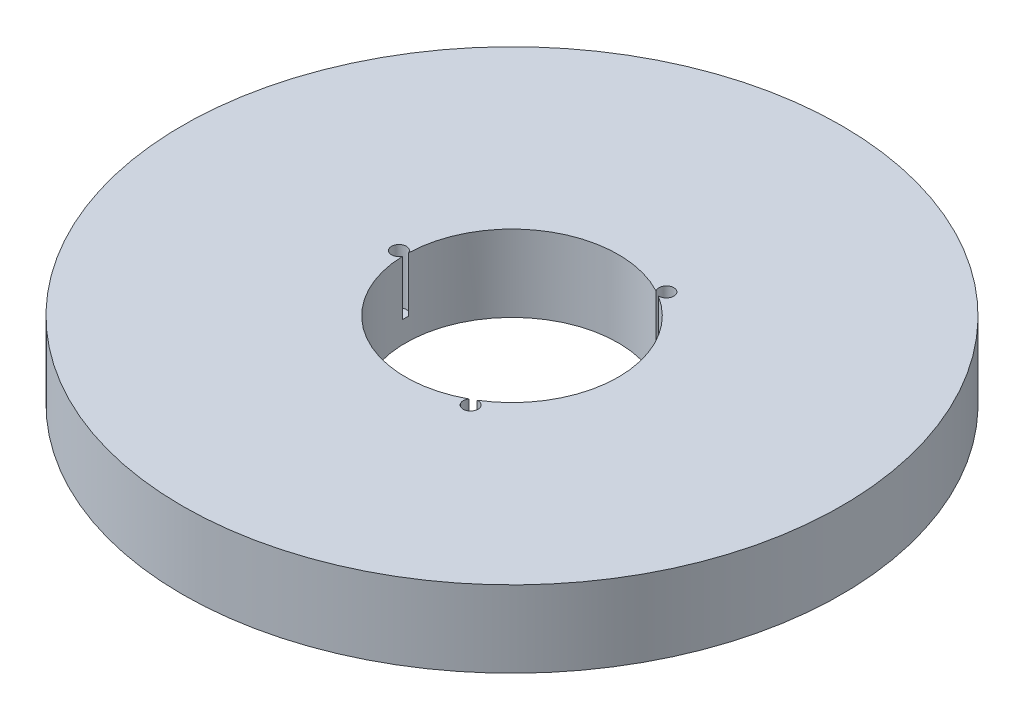
ISO-10303-21;
HEADER;
FILE_DESCRIPTION(('STEP AP214'),'2;1');
FILE_NAME('part.step','',(''),(''),'','','');
FILE_SCHEMA(('AUTOMOTIVE_DESIGN { 1 0 10303 214 1 1 1 1 }'));
ENDSEC;
DATA;
#1=APPLICATION_CONTEXT('core data for automotive mechanical design processes');
#2=APPLICATION_PROTOCOL_DEFINITION('international standard','automotive_design',2000,#1);
#3=PRODUCT_CONTEXT('',#1,'mechanical');
#4=PRODUCT('Part','Part','',(#3));
#5=PRODUCT_RELATED_PRODUCT_CATEGORY('part','',(#4));
#6=PRODUCT_DEFINITION_FORMATION('','',#4);
#7=PRODUCT_DEFINITION_CONTEXT('part definition',#1,'design');
#8=PRODUCT_DEFINITION('design','',#6,#7);
#9=PRODUCT_DEFINITION_SHAPE('','',#8);
#10=(LENGTH_UNIT() NAMED_UNIT(*) SI_UNIT(.MILLI.,.METRE.));
#11=(NAMED_UNIT(*) PLANE_ANGLE_UNIT() SI_UNIT($,.RADIAN.));
#12=(NAMED_UNIT(*) SI_UNIT($,.STERADIAN.) SOLID_ANGLE_UNIT());
#13=UNCERTAINTY_MEASURE_WITH_UNIT(LENGTH_MEASURE(1.E-05),#10,'distance_accuracy_value','');
#14=(GEOMETRIC_REPRESENTATION_CONTEXT(3) GLOBAL_UNCERTAINTY_ASSIGNED_CONTEXT((#13)) GLOBAL_UNIT_ASSIGNED_CONTEXT((#10,
#11,#12)) REPRESENTATION_CONTEXT('',''));
#15=CARTESIAN_POINT('',(0.,0.,0.));
#16=DIRECTION('',(0.,0.,1.));
#17=DIRECTION('',(1.,0.,0.));
#18=AXIS2_PLACEMENT_3D('',#15,#16,#17);
#19=CARTESIAN_POINT('',(0.,18.,0.));
#20=DIRECTION('',(0.,-1.,0.));
#21=DIRECTION('',(0.,0.,-1.));
#22=AXIS2_PLACEMENT_3D('',#19,#20,#21);
#23=CYLINDRICAL_SURFACE('',#22,77.5);
#24=CARTESIAN_POINT('',(0.,18.,0.));
#25=DIRECTION('',(0.,1.,0.));
#26=DIRECTION('',(0.,0.,1.));
#27=AXIS2_PLACEMENT_3D('',#24,#25,#26);
#28=CIRCLE('',#27,77.5);
#29=CARTESIAN_POINT('',(0.,18.,77.5));
#30=VERTEX_POINT('',#29);
#31=EDGE_CURVE('E126',#30,#30,#28,.T.);
#32=ORIENTED_EDGE('',*,*,#31,.F.);
#33=EDGE_LOOP('',(#32));
#34=FACE_BOUND('',#33,.T.);
#35=CARTESIAN_POINT('',(0.,0.,0.));
#36=DIRECTION('',(0.,1.,0.));
#37=DIRECTION('',(0.,0.,1.));
#38=AXIS2_PLACEMENT_3D('',#35,#36,#37);
#39=CIRCLE('',#38,77.5);
#40=CARTESIAN_POINT('',(0.,0.,77.5));
#41=VERTEX_POINT('',#40);
#42=EDGE_CURVE('E124',#41,#41,#39,.T.);
#43=ORIENTED_EDGE('',*,*,#42,.T.);
#44=EDGE_LOOP('',(#43));
#45=FACE_BOUND('',#44,.T.);
#46=ADVANCED_FACE('F39',(#34,#45),#23,.T.);
#47=CARTESIAN_POINT('',(0.,18.,0.));
#48=DIRECTION('',(0.,1.,0.));
#49=DIRECTION('',(0.,0.,1.));
#50=AXIS2_PLACEMENT_3D('',#47,#48,#49);
#51=PLANE('',#50);
#52=CARTESIAN_POINT('',(13.2918245483509,18.,23.0221154430348));
#53=DIRECTION('',(0.,1.,0.));
#54=DIRECTION('',(0.866025403784436,0.,-0.500000000000004));
#55=AXIS2_PLACEMENT_3D('',#52,#53,#54);
#56=CIRCLE('',#55,1.74348970429529);
#57=CARTESIAN_POINT('',(11.8826075329255,18.,21.9955367795028));
#58=VERTEX_POINT('',#57);
#59=CARTESIAN_POINT('',(13.1073898544619,18.,21.2884083764651));
#60=VERTEX_POINT('',#59);
#61=EDGE_CURVE('E147',#58,#60,#56,.T.);
#62=ORIENTED_EDGE('',*,*,#61,.F.);
#63=CARTESIAN_POINT('',(0.,18.,0.));
#64=DIRECTION('',(0.,1.,0.));
#65=DIRECTION('',(0.,0.,1.));
#66=AXIS2_PLACEMENT_3D('',#63,#64,#65);
#67=CIRCLE('',#66,25.);
#68=CARTESIAN_POINT('',(-24.9899973873872,18.,0.707128403037722));
#69=VERTEX_POINT('',#68);
#70=EDGE_CURVE('E118',#69,#58,#67,.T.);
#71=ORIENTED_EDGE('',*,*,#70,.F.);
#72=CARTESIAN_POINT('',(-26.5836490967017,18.,0.));
#73=DIRECTION('',(0.,1.,0.));
#74=DIRECTION('',(0.,0.,1.));
#75=AXIS2_PLACEMENT_3D('',#72,#73,#74);
#76=CIRCLE('',#75,1.74348970429529);
#77=CARTESIAN_POINT('',(-24.9899973873872,18.,-0.707128403037722));
#78=VERTEX_POINT('',#77);
#79=EDGE_CURVE('E113',#78,#69,#76,.T.);
#80=ORIENTED_EDGE('',*,*,#79,.F.);
#81=CARTESIAN_POINT('',(11.8826075329252,18.,-21.995536779503));
#82=VERTEX_POINT('',#81);
#83=EDGE_CURVE('E106',#82,#78,#67,.T.);
#84=ORIENTED_EDGE('',*,*,#83,.F.);
#85=CARTESIAN_POINT('',(13.2918245483506,18.,-23.022115443035));
#86=DIRECTION('',(0.,1.,0.));
#87=DIRECTION('',(-0.866025403784443,0.,-0.499999999999992));
#88=AXIS2_PLACEMENT_3D('',#85,#86,#87);
#89=CIRCLE('',#88,1.74348970429529);
#90=CARTESIAN_POINT('',(13.1073898544616,18.,-21.2884083764653));
#91=VERTEX_POINT('',#90);
#92=EDGE_CURVE('E90',#91,#82,#89,.T.);
#93=ORIENTED_EDGE('',*,*,#92,.F.);
#94=EDGE_CURVE('E116',#60,#91,#67,.T.);
#95=ORIENTED_EDGE('',*,*,#94,.F.);
#96=EDGE_LOOP('',(#62,#71,#80,#84,#93,#95));
#97=FACE_BOUND('',#96,.T.);
#98=ORIENTED_EDGE('',*,*,#31,.T.);
#99=EDGE_LOOP('',(#98));
#100=FACE_BOUND('',#99,.T.);
#101=ADVANCED_FACE('F115',(#97,#100),#51,.T.);
#102=CARTESIAN_POINT('',(0.,0.,0.));
#103=DIRECTION('',(0.,1.,0.));
#104=DIRECTION('',(0.,0.,1.));
#105=AXIS2_PLACEMENT_3D('',#102,#103,#104);
#106=PLANE('',#105);
#107=CARTESIAN_POINT('',(0.,0.,0.));
#108=DIRECTION('',(0.,1.,0.));
#109=DIRECTION('',(0.,0.,1.));
#110=AXIS2_PLACEMENT_3D('',#107,#108,#109);
#111=CIRCLE('',#110,25.);
#112=CARTESIAN_POINT('',(0.,0.,25.));
#113=VERTEX_POINT('',#112);
#114=EDGE_CURVE('E120',#113,#113,#111,.T.);
#115=ORIENTED_EDGE('',*,*,#114,.T.);
#116=EDGE_LOOP('',(#115));
#117=FACE_BOUND('',#116,.T.);
#118=ORIENTED_EDGE('',*,*,#42,.F.);
#119=EDGE_LOOP('',(#118));
#120=FACE_BOUND('',#119,.T.);
#121=ADVANCED_FACE('F164',(#117,#120),#106,.F.);
#122=CARTESIAN_POINT('',(0.,18.,0.));
#123=DIRECTION('',(0.,-1.,0.));
#124=DIRECTION('',(0.,0.,-1.));
#125=AXIS2_PLACEMENT_3D('',#122,#123,#124);
#126=CYLINDRICAL_SURFACE('',#125,25.);
#127=DIRECTION('',(0.,1.,0.));
#128=VECTOR('',#127,1.);
#129=CARTESIAN_POINT('',(11.8826075329255,11.5554604825407,21.9955367795028));
#130=LINE('',#129,#128);
#131=CARTESIAN_POINT('',(11.8826075329255,5.11092096508139,21.9955367795028));
#132=VERTEX_POINT('',#131);
#133=EDGE_CURVE('E11',#132,#58,#130,.T.);
#134=ORIENTED_EDGE('',*,*,#133,.F.);
#135=CARTESIAN_POINT('',(0.,5.11092096508139,0.));
#136=DIRECTION('',(0.,1.,0.));
#137=DIRECTION('',(0.,0.,1.));
#138=AXIS2_PLACEMENT_3D('',#135,#136,#137);
#139=CIRCLE('',#138,25.);
#140=CARTESIAN_POINT('',(13.1073898544619,5.11092096508139,21.2884083764651));
#141=VERTEX_POINT('',#140);
#142=EDGE_CURVE('E144',#132,#141,#139,.T.);
#143=ORIENTED_EDGE('',*,*,#142,.T.);
#144=DIRECTION('',(0.,1.,0.));
#145=VECTOR('',#144,1.);
#146=CARTESIAN_POINT('',(13.1073898544619,11.5554604825407,21.2884083764651));
#147=LINE('',#146,#145);
#148=EDGE_CURVE('E46',#60,#141,#147,.F.);
#149=ORIENTED_EDGE('',*,*,#148,.F.);
#150=ORIENTED_EDGE('',*,*,#94,.T.);
#151=DIRECTION('',(0.,1.,0.));
#152=VECTOR('',#151,1.);
#153=CARTESIAN_POINT('',(13.1073898544616,11.5554604825407,-21.2884083764653));
#154=LINE('',#153,#152);
#155=CARTESIAN_POINT('',(13.1073898544616,5.11092096508139,-21.2884083764653));
#156=VERTEX_POINT('',#155);
#157=EDGE_CURVE('E92',#156,#91,#154,.T.);
#158=ORIENTED_EDGE('',*,*,#157,.F.);
#159=CARTESIAN_POINT('',(0.,5.11092096508139,0.));
#160=DIRECTION('',(0.,1.,0.));
#161=DIRECTION('',(0.,0.,1.));
#162=AXIS2_PLACEMENT_3D('',#159,#160,#161);
#163=CIRCLE('',#162,25.);
#164=CARTESIAN_POINT('',(11.8826075329252,5.11092096508139,-21.995536779503));
#165=VERTEX_POINT('',#164);
#166=EDGE_CURVE('E107',#156,#165,#163,.T.);
#167=ORIENTED_EDGE('',*,*,#166,.T.);
#168=DIRECTION('',(0.,1.,0.));
#169=VECTOR('',#168,1.);
#170=CARTESIAN_POINT('',(11.8826075329252,11.5554604825407,-21.995536779503));
#171=LINE('',#170,#169);
#172=EDGE_CURVE('E95',#82,#165,#171,.F.);
#173=ORIENTED_EDGE('',*,*,#172,.F.);
#174=ORIENTED_EDGE('',*,*,#83,.T.);
#175=DIRECTION('',(0.,1.,0.));
#176=VECTOR('',#175,1.);
#177=CARTESIAN_POINT('',(-24.9899973873872,11.5554604825407,-0.707128403037714));
#178=LINE('',#177,#176);
#179=CARTESIAN_POINT('',(-24.9899973873872,5.11092096508139,-0.707128403037722));
#180=VERTEX_POINT('',#179);
#181=EDGE_CURVE('E143',#180,#78,#178,.T.);
#182=ORIENTED_EDGE('',*,*,#181,.F.);
#183=CARTESIAN_POINT('',(0.,5.11092096508139,0.));
#184=DIRECTION('',(0.,1.,0.));
#185=DIRECTION('',(0.,0.,1.));
#186=AXIS2_PLACEMENT_3D('',#183,#184,#185);
#187=CIRCLE('',#186,25.);
#188=CARTESIAN_POINT('',(-24.9899973873872,5.11092096508139,0.707128403037722));
#189=VERTEX_POINT('',#188);
#190=EDGE_CURVE('E132',#180,#189,#187,.T.);
#191=ORIENTED_EDGE('',*,*,#190,.T.);
#192=DIRECTION('',(0.,1.,0.));
#193=VECTOR('',#192,1.);
#194=CARTESIAN_POINT('',(-24.9899973873872,11.5554604825407,0.707128403037714));
#195=LINE('',#194,#193);
#196=EDGE_CURVE('E137',#69,#189,#195,.F.);
#197=ORIENTED_EDGE('',*,*,#196,.F.);
#198=ORIENTED_EDGE('',*,*,#70,.T.);
#199=EDGE_LOOP('',(#134,#143,#149,#150,#158,#167,#173,#174,#182,#191,#197,#198));
#200=FACE_BOUND('',#199,.T.);
#201=ORIENTED_EDGE('',*,*,#114,.F.);
#202=EDGE_LOOP('',(#201));
#203=FACE_BOUND('',#202,.T.);
#204=ADVANCED_FACE('F103',(#200,#203),#126,.F.);
#205=CARTESIAN_POINT('',(-26.5836490967017,5.11092096508139,0.));
#206=DIRECTION('',(0.,1.,0.));
#207=DIRECTION('',(0.,0.,1.));
#208=AXIS2_PLACEMENT_3D('',#205,#206,#207);
#209=CYLINDRICAL_SURFACE('',#208,1.74348970429529);
#210=ORIENTED_EDGE('',*,*,#181,.T.);
#211=ORIENTED_EDGE('',*,*,#79,.T.);
#212=ORIENTED_EDGE('',*,*,#196,.T.);
#213=CARTESIAN_POINT('',(-26.5836490967017,5.11092096508139,0.));
#214=DIRECTION('',(0.,1.,0.));
#215=DIRECTION('',(0.,0.,1.));
#216=AXIS2_PLACEMENT_3D('',#213,#214,#215);
#217=CIRCLE('',#216,1.74348970429529);
#218=EDGE_CURVE('E121',#180,#189,#217,.T.);
#219=ORIENTED_EDGE('',*,*,#218,.F.);
#220=EDGE_LOOP('',(#210,#211,#212,#219));
#221=FACE_BOUND('',#220,.T.);
#222=ADVANCED_FACE('F174',(#221),#209,.F.);
#223=CARTESIAN_POINT('',(-26.5836490967017,5.11092096508139,0.));
#224=DIRECTION('',(0.,1.,0.));
#225=DIRECTION('',(0.,0.,1.));
#226=AXIS2_PLACEMENT_3D('',#223,#224,#225);
#227=PLANE('',#226);
#228=ORIENTED_EDGE('',*,*,#218,.T.);
#229=ORIENTED_EDGE('',*,*,#190,.F.);
#230=EDGE_LOOP('',(#228,#229));
#231=FACE_BOUND('',#230,.T.);
#232=ADVANCED_FACE('F177',(#231),#227,.T.);
#233=CARTESIAN_POINT('',(13.2918245483506,5.11092096508139,-23.022115443035));
#234=DIRECTION('',(0.,1.,0.));
#235=DIRECTION('',(0.,0.,1.));
#236=AXIS2_PLACEMENT_3D('',#233,#234,#235);
#237=CYLINDRICAL_SURFACE('',#236,1.74348970429529);
#238=ORIENTED_EDGE('',*,*,#157,.T.);
#239=ORIENTED_EDGE('',*,*,#92,.T.);
#240=ORIENTED_EDGE('',*,*,#172,.T.);
#241=CARTESIAN_POINT('',(13.2918245483506,5.11092096508139,-23.022115443035));
#242=DIRECTION('',(0.,1.,0.));
#243=DIRECTION('',(-0.866025403784443,0.,-0.499999999999992));
#244=AXIS2_PLACEMENT_3D('',#241,#242,#243);
#245=CIRCLE('',#244,1.74348970429529);
#246=EDGE_CURVE('E56',#156,#165,#245,.T.);
#247=ORIENTED_EDGE('',*,*,#246,.F.);
#248=EDGE_LOOP('',(#238,#239,#240,#247));
#249=FACE_BOUND('',#248,.T.);
#250=ADVANCED_FACE('F93',(#249),#237,.F.);
#251=CARTESIAN_POINT('',(13.2918245483506,5.11092096508139,-23.022115443035));
#252=DIRECTION('',(0.,1.,0.));
#253=DIRECTION('',(-0.866025403784443,0.,-0.499999999999992));
#254=AXIS2_PLACEMENT_3D('',#251,#252,#253);
#255=PLANE('',#254);
#256=ORIENTED_EDGE('',*,*,#246,.T.);
#257=ORIENTED_EDGE('',*,*,#166,.F.);
#258=EDGE_LOOP('',(#256,#257));
#259=FACE_BOUND('',#258,.T.);
#260=ADVANCED_FACE('F160',(#259),#255,.T.);
#261=CARTESIAN_POINT('',(13.2918245483509,5.11092096508139,23.0221154430348));
#262=DIRECTION('',(0.,1.,0.));
#263=DIRECTION('',(0.,0.,1.));
#264=AXIS2_PLACEMENT_3D('',#261,#262,#263);
#265=CYLINDRICAL_SURFACE('',#264,1.74348970429529);
#266=ORIENTED_EDGE('',*,*,#133,.T.);
#267=ORIENTED_EDGE('',*,*,#61,.T.);
#268=ORIENTED_EDGE('',*,*,#148,.T.);
#269=CARTESIAN_POINT('',(13.2918245483509,5.11092096508139,23.0221154430348));
#270=DIRECTION('',(0.,1.,0.));
#271=DIRECTION('',(0.866025403784436,0.,-0.500000000000004));
#272=AXIS2_PLACEMENT_3D('',#269,#270,#271);
#273=CIRCLE('',#272,1.74348970429529);
#274=EDGE_CURVE('E55',#132,#141,#273,.T.);
#275=ORIENTED_EDGE('',*,*,#274,.F.);
#276=EDGE_LOOP('',(#266,#267,#268,#275));
#277=FACE_BOUND('',#276,.T.);
#278=ADVANCED_FACE('F149',(#277),#265,.F.);
#279=CARTESIAN_POINT('',(13.2918245483509,5.11092096508139,23.0221154430348));
#280=DIRECTION('',(0.,1.,0.));
#281=DIRECTION('',(0.866025403784436,0.,-0.500000000000004));
#282=AXIS2_PLACEMENT_3D('',#279,#280,#281);
#283=PLANE('',#282);
#284=ORIENTED_EDGE('',*,*,#274,.T.);
#285=ORIENTED_EDGE('',*,*,#142,.F.);
#286=EDGE_LOOP('',(#284,#285));
#287=FACE_BOUND('',#286,.T.);
#288=ADVANCED_FACE('F151',(#287),#283,.T.);
#289=CLOSED_SHELL('',(#46,#101,#121,#204,#222,#232,#250,#260,#278,#288));
#290=MANIFOLD_SOLID_BREP('B2',#289);
#291=ADVANCED_BREP_SHAPE_REPRESENTATION('',(#18,#290),#14);
#292=SHAPE_DEFINITION_REPRESENTATION(#9,#291);
ENDSEC;
END-ISO-10303-21;
